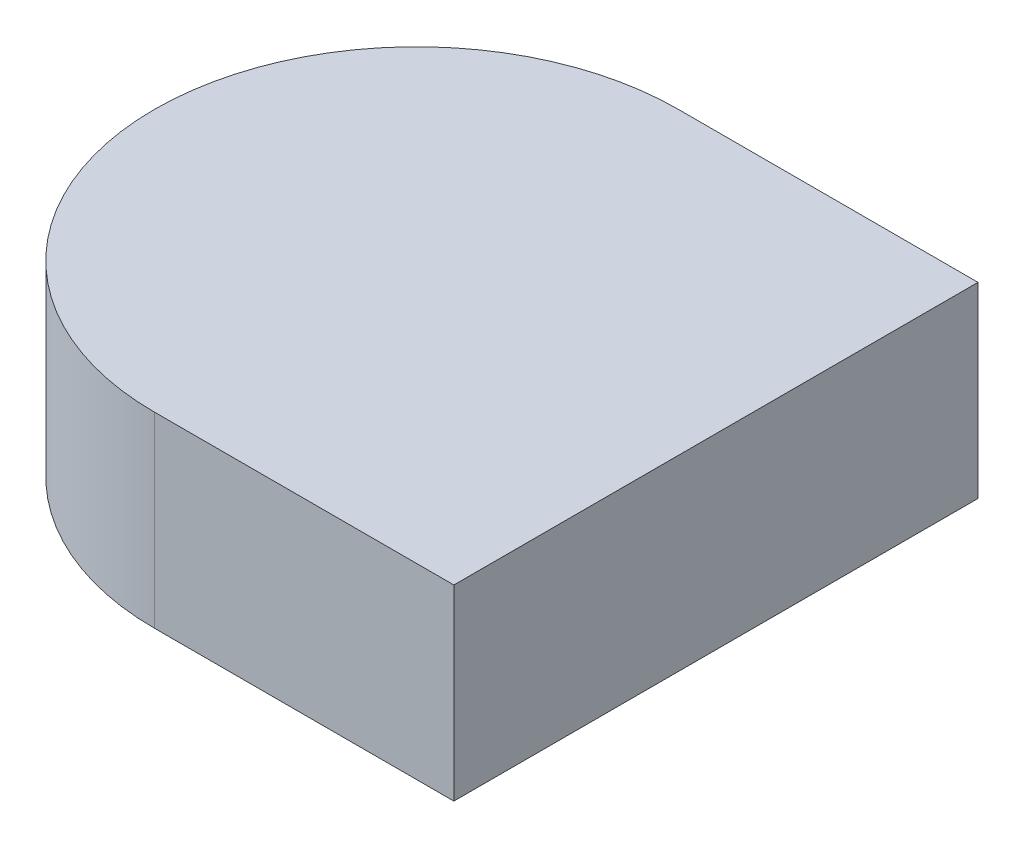
ISO-10303-21;
HEADER;
FILE_DESCRIPTION(('STEP AP214'),'2;1');
FILE_NAME('part.step','',(''),(''),'','','');
FILE_SCHEMA(('AUTOMOTIVE_DESIGN { 1 0 10303 214 1 1 1 1 }'));
ENDSEC;
DATA;
#1=APPLICATION_CONTEXT('core data for automotive mechanical design processes');
#2=APPLICATION_PROTOCOL_DEFINITION('international standard','automotive_design',2000,#1);
#3=PRODUCT_CONTEXT('',#1,'mechanical');
#4=PRODUCT('Part','Part','',(#3));
#5=PRODUCT_RELATED_PRODUCT_CATEGORY('part','',(#4));
#6=PRODUCT_DEFINITION_FORMATION('','',#4);
#7=PRODUCT_DEFINITION_CONTEXT('part definition',#1,'design');
#8=PRODUCT_DEFINITION('design','',#6,#7);
#9=PRODUCT_DEFINITION_SHAPE('','',#8);
#10=(LENGTH_UNIT() NAMED_UNIT(*) SI_UNIT(.MILLI.,.METRE.));
#11=(NAMED_UNIT(*) PLANE_ANGLE_UNIT() SI_UNIT($,.RADIAN.));
#12=(NAMED_UNIT(*) SI_UNIT($,.STERADIAN.) SOLID_ANGLE_UNIT());
#13=UNCERTAINTY_MEASURE_WITH_UNIT(LENGTH_MEASURE(1.E-05),#10,'distance_accuracy_value','');
#14=(GEOMETRIC_REPRESENTATION_CONTEXT(3) GLOBAL_UNCERTAINTY_ASSIGNED_CONTEXT((#13)) GLOBAL_UNIT_ASSIGNED_CONTEXT((#10,
#11,#12)) REPRESENTATION_CONTEXT('',''));
#15=CARTESIAN_POINT('',(0.,0.,0.));
#16=DIRECTION('',(0.,0.,1.));
#17=DIRECTION('',(1.,0.,0.));
#18=AXIS2_PLACEMENT_3D('',#15,#16,#17);
#19=CARTESIAN_POINT('',(5.08,-3.175,4.445));
#20=DIRECTION('',(0.,1.,0.));
#21=DIRECTION('',(-1.,0.,0.));
#22=AXIS2_PLACEMENT_3D('',#19,#20,#21);
#23=PLANE('',#22);
#24=DIRECTION('',(0.,0.,-1.));
#25=VECTOR('',#24,1.);
#26=CARTESIAN_POINT('',(-2.54,-3.175,2.54));
#27=LINE('',#26,#25);
#28=CARTESIAN_POINT('',(-2.54,-3.175,2.54));
#29=VERTEX_POINT('',#28);
#30=CARTESIAN_POINT('',(-2.54,-3.175,-2.54));
#31=VERTEX_POINT('',#30);
#32=EDGE_CURVE('E148',#29,#31,#27,.T.);
#33=ORIENTED_EDGE('',*,*,#32,.F.);
#34=DIRECTION('',(-1.,0.,0.));
#35=VECTOR('',#34,1.);
#36=CARTESIAN_POINT('',(2.54,-3.175,2.54));
#37=LINE('',#36,#35);
#38=CARTESIAN_POINT('',(2.54,-3.175,2.54));
#39=VERTEX_POINT('',#38);
#40=EDGE_CURVE('E59',#39,#29,#37,.T.);
#41=ORIENTED_EDGE('',*,*,#40,.F.);
#42=DIRECTION('',(0.,0.,1.));
#43=VECTOR('',#42,1.);
#44=CARTESIAN_POINT('',(2.54,-3.175,-2.54));
#45=LINE('',#44,#43);
#46=CARTESIAN_POINT('',(2.54,-3.175,-2.54));
#47=VERTEX_POINT('',#46);
#48=EDGE_CURVE('E141',#47,#39,#45,.T.);
#49=ORIENTED_EDGE('',*,*,#48,.F.);
#50=DIRECTION('',(1.,0.,0.));
#51=VECTOR('',#50,1.);
#52=CARTESIAN_POINT('',(-2.54,-3.175,-2.54));
#53=LINE('',#52,#51);
#54=EDGE_CURVE('E145',#31,#47,#53,.T.);
#55=ORIENTED_EDGE('',*,*,#54,.F.);
#56=EDGE_LOOP('',(#33,#41,#49,#55));
#57=FACE_BOUND('',#56,.T.);
#58=DIRECTION('',(1.,0.,0.));
#59=VECTOR('',#58,1.);
#60=CARTESIAN_POINT('',(5.08,-3.175,4.445));
#61=LINE('',#60,#59);
#62=CARTESIAN_POINT('',(0.,-3.175,4.445));
#63=VERTEX_POINT('',#62);
#64=CARTESIAN_POINT('',(5.08,-3.175,4.445));
#65=VERTEX_POINT('',#64);
#66=EDGE_CURVE('E124',#63,#65,#61,.T.);
#67=ORIENTED_EDGE('',*,*,#66,.F.);
#68=CARTESIAN_POINT('',(0.,-3.175,0.));
#69=DIRECTION('',(0.,-1.,0.));
#70=DIRECTION('',(0.,0.,1.));
#71=AXIS2_PLACEMENT_3D('',#68,#69,#70);
#72=CIRCLE('',#71,4.445);
#73=CARTESIAN_POINT('',(0.,-3.175,-4.445));
#74=VERTEX_POINT('',#73);
#75=EDGE_CURVE('E163',#63,#74,#72,.T.);
#76=ORIENTED_EDGE('',*,*,#75,.T.);
#77=DIRECTION('',(1.,0.,0.));
#78=VECTOR('',#77,1.);
#79=CARTESIAN_POINT('',(5.08,-3.175,-4.445));
#80=LINE('',#79,#78);
#81=CARTESIAN_POINT('',(5.08,-3.175,-4.445));
#82=VERTEX_POINT('',#81);
#83=EDGE_CURVE('E103',#74,#82,#80,.T.);
#84=ORIENTED_EDGE('',*,*,#83,.T.);
#85=DIRECTION('',(0.,0.,-1.));
#86=VECTOR('',#85,1.);
#87=CARTESIAN_POINT('',(5.08,-3.175,4.445));
#88=LINE('',#87,#86);
#89=EDGE_CURVE('E12',#65,#82,#88,.T.);
#90=ORIENTED_EDGE('',*,*,#89,.F.);
#91=EDGE_LOOP('',(#67,#76,#84,#90));
#92=FACE_BOUND('',#91,.T.);
#93=ADVANCED_FACE('F36',(#57,#92),#23,.F.);
#94=CARTESIAN_POINT('',(5.08,0.,4.445));
#95=DIRECTION('',(-1.,0.,0.));
#96=DIRECTION('',(0.,0.,1.));
#97=AXIS2_PLACEMENT_3D('',#94,#95,#96);
#98=PLANE('',#97);
#99=DIRECTION('',(0.,1.,0.));
#100=VECTOR('',#99,1.);
#101=CARTESIAN_POINT('',(5.08,0.,-4.445));
#102=LINE('',#101,#100);
#103=CARTESIAN_POINT('',(5.08,0.,-4.445));
#104=VERTEX_POINT('',#103);
#105=EDGE_CURVE('E108',#82,#104,#102,.T.);
#106=ORIENTED_EDGE('',*,*,#105,.T.);
#107=DIRECTION('',(0.,0.,-1.));
#108=VECTOR('',#107,1.);
#109=CARTESIAN_POINT('',(5.08,0.,4.445));
#110=LINE('',#109,#108);
#111=CARTESIAN_POINT('',(5.08,0.,4.445));
#112=VERTEX_POINT('',#111);
#113=EDGE_CURVE('E44',#112,#104,#110,.T.);
#114=ORIENTED_EDGE('',*,*,#113,.F.);
#115=DIRECTION('',(0.,1.,0.));
#116=VECTOR('',#115,1.);
#117=CARTESIAN_POINT('',(5.08,0.,4.445));
#118=LINE('',#117,#116);
#119=EDGE_CURVE('E126',#65,#112,#118,.T.);
#120=ORIENTED_EDGE('',*,*,#119,.F.);
#121=ORIENTED_EDGE('',*,*,#89,.T.);
#122=EDGE_LOOP('',(#106,#114,#120,#121));
#123=FACE_BOUND('',#122,.T.);
#124=ADVANCED_FACE('F110',(#123),#98,.F.);
#125=CARTESIAN_POINT('',(-5.08,0.,4.445));
#126=DIRECTION('',(0.,-1.,0.));
#127=DIRECTION('',(0.,0.,-1.));
#128=AXIS2_PLACEMENT_3D('',#125,#126,#127);
#129=PLANE('',#128);
#130=DIRECTION('',(-1.,0.,0.));
#131=VECTOR('',#130,1.);
#132=CARTESIAN_POINT('',(-5.08,0.,-4.445));
#133=LINE('',#132,#131);
#134=CARTESIAN_POINT('',(0.,0.,-4.445));
#135=VERTEX_POINT('',#134);
#136=EDGE_CURVE('E115',#104,#135,#133,.T.);
#137=ORIENTED_EDGE('',*,*,#136,.T.);
#138=CARTESIAN_POINT('',(0.,0.,0.));
#139=DIRECTION('',(0.,1.,0.));
#140=DIRECTION('',(0.,0.,1.));
#141=AXIS2_PLACEMENT_3D('',#138,#139,#140);
#142=CIRCLE('',#141,4.445);
#143=CARTESIAN_POINT('',(0.,0.,4.445));
#144=VERTEX_POINT('',#143);
#145=EDGE_CURVE('E39',#144,#135,#142,.F.);
#146=ORIENTED_EDGE('',*,*,#145,.F.);
#147=DIRECTION('',(-1.,0.,0.));
#148=VECTOR('',#147,1.);
#149=CARTESIAN_POINT('',(-5.08,0.,4.445));
#150=LINE('',#149,#148);
#151=EDGE_CURVE('E121',#112,#144,#150,.T.);
#152=ORIENTED_EDGE('',*,*,#151,.F.);
#153=ORIENTED_EDGE('',*,*,#113,.T.);
#154=EDGE_LOOP('',(#137,#146,#152,#153));
#155=FACE_BOUND('',#154,.T.);
#156=ADVANCED_FACE('F119',(#155),#129,.F.);
#157=CARTESIAN_POINT('',(0.,0.,4.445));
#158=DIRECTION('',(0.,0.,-1.));
#159=DIRECTION('',(-1.,0.,0.));
#160=AXIS2_PLACEMENT_3D('',#157,#158,#159);
#161=PLANE('',#160);
#162=ORIENTED_EDGE('',*,*,#151,.T.);
#163=DIRECTION('',(0.,1.,0.));
#164=VECTOR('',#163,1.);
#165=CARTESIAN_POINT('',(0.,-3.175,4.445));
#166=LINE('',#165,#164);
#167=EDGE_CURVE('E71',#63,#144,#166,.T.);
#168=ORIENTED_EDGE('',*,*,#167,.F.);
#169=ORIENTED_EDGE('',*,*,#66,.T.);
#170=ORIENTED_EDGE('',*,*,#119,.T.);
#171=EDGE_LOOP('',(#162,#168,#169,#170));
#172=FACE_BOUND('',#171,.T.);
#173=ADVANCED_FACE('F204',(#172),#161,.F.);
#174=CARTESIAN_POINT('',(0.,0.,-4.445));
#175=DIRECTION('',(0.,0.,-1.));
#176=DIRECTION('',(-1.,0.,0.));
#177=AXIS2_PLACEMENT_3D('',#174,#175,#176);
#178=PLANE('',#177);
#179=DIRECTION('',(0.,1.,0.));
#180=VECTOR('',#179,1.);
#181=CARTESIAN_POINT('',(0.,-3.175,-4.445));
#182=LINE('',#181,#180);
#183=EDGE_CURVE('E74',#74,#135,#182,.T.);
#184=ORIENTED_EDGE('',*,*,#183,.T.);
#185=ORIENTED_EDGE('',*,*,#136,.F.);
#186=ORIENTED_EDGE('',*,*,#105,.F.);
#187=ORIENTED_EDGE('',*,*,#83,.F.);
#188=EDGE_LOOP('',(#184,#185,#186,#187));
#189=FACE_BOUND('',#188,.T.);
#190=ADVANCED_FACE('F123',(#189),#178,.T.);
#191=CARTESIAN_POINT('',(2.54,-1.27,2.54));
#192=DIRECTION('',(0.,0.,1.));
#193=DIRECTION('',(1.,0.,0.));
#194=AXIS2_PLACEMENT_3D('',#191,#192,#193);
#195=PLANE('',#194);
#196=ORIENTED_EDGE('',*,*,#40,.T.);
#197=DIRECTION('',(0.,-1.,0.));
#198=VECTOR('',#197,1.);
#199=CARTESIAN_POINT('',(-2.54,-1.27,2.54));
#200=LINE('',#199,#198);
#201=CARTESIAN_POINT('',(-2.54,-1.27,2.54));
#202=VERTEX_POINT('',#201);
#203=EDGE_CURVE('E133',#202,#29,#200,.T.);
#204=ORIENTED_EDGE('',*,*,#203,.F.);
#205=DIRECTION('',(-1.,0.,0.));
#206=VECTOR('',#205,1.);
#207=CARTESIAN_POINT('',(2.54,-1.27,2.54));
#208=LINE('',#207,#206);
#209=CARTESIAN_POINT('',(2.54,-1.27,2.54));
#210=VERTEX_POINT('',#209);
#211=EDGE_CURVE('E144',#210,#202,#208,.T.);
#212=ORIENTED_EDGE('',*,*,#211,.F.);
#213=DIRECTION('',(0.,-1.,0.));
#214=VECTOR('',#213,1.);
#215=CARTESIAN_POINT('',(2.54,-1.27,2.54));
#216=LINE('',#215,#214);
#217=EDGE_CURVE('E130',#210,#39,#216,.T.);
#218=ORIENTED_EDGE('',*,*,#217,.T.);
#219=EDGE_LOOP('',(#196,#204,#212,#218));
#220=FACE_BOUND('',#219,.T.);
#221=ADVANCED_FACE('F190',(#220),#195,.F.);
#222=CARTESIAN_POINT('',(2.54,-1.27,-2.54));
#223=DIRECTION('',(1.,0.,0.));
#224=DIRECTION('',(0.,1.,0.));
#225=AXIS2_PLACEMENT_3D('',#222,#223,#224);
#226=PLANE('',#225);
#227=ORIENTED_EDGE('',*,*,#48,.T.);
#228=ORIENTED_EDGE('',*,*,#217,.F.);
#229=DIRECTION('',(0.,0.,1.));
#230=VECTOR('',#229,1.);
#231=CARTESIAN_POINT('',(2.54,-1.27,-2.54));
#232=LINE('',#231,#230);
#233=CARTESIAN_POINT('',(2.54,-1.27,-2.54));
#234=VERTEX_POINT('',#233);
#235=EDGE_CURVE('E136',#234,#210,#232,.T.);
#236=ORIENTED_EDGE('',*,*,#235,.F.);
#237=DIRECTION('',(0.,-1.,0.));
#238=VECTOR('',#237,1.);
#239=CARTESIAN_POINT('',(2.54,-1.27,-2.54));
#240=LINE('',#239,#238);
#241=EDGE_CURVE('E138',#234,#47,#240,.T.);
#242=ORIENTED_EDGE('',*,*,#241,.T.);
#243=EDGE_LOOP('',(#227,#228,#236,#242));
#244=FACE_BOUND('',#243,.T.);
#245=ADVANCED_FACE('F198',(#244),#226,.F.);
#246=CARTESIAN_POINT('',(-2.54,-1.27,-2.54));
#247=DIRECTION('',(0.,0.,-1.));
#248=DIRECTION('',(-1.,0.,0.));
#249=AXIS2_PLACEMENT_3D('',#246,#247,#248);
#250=PLANE('',#249);
#251=ORIENTED_EDGE('',*,*,#54,.T.);
#252=ORIENTED_EDGE('',*,*,#241,.F.);
#253=DIRECTION('',(1.,0.,0.));
#254=VECTOR('',#253,1.);
#255=CARTESIAN_POINT('',(-2.54,-1.27,-2.54));
#256=LINE('',#255,#254);
#257=CARTESIAN_POINT('',(-2.54,-1.27,-2.54));
#258=VERTEX_POINT('',#257);
#259=EDGE_CURVE('E154',#258,#234,#256,.T.);
#260=ORIENTED_EDGE('',*,*,#259,.F.);
#261=DIRECTION('',(0.,-1.,0.));
#262=VECTOR('',#261,1.);
#263=CARTESIAN_POINT('',(-2.54,-1.27,-2.54));
#264=LINE('',#263,#262);
#265=EDGE_CURVE('E135',#258,#31,#264,.T.);
#266=ORIENTED_EDGE('',*,*,#265,.T.);
#267=EDGE_LOOP('',(#251,#252,#260,#266));
#268=FACE_BOUND('',#267,.T.);
#269=ADVANCED_FACE('F196',(#268),#250,.F.);
#270=CARTESIAN_POINT('',(-2.54,-1.27,2.54));
#271=DIRECTION('',(-1.,0.,0.));
#272=DIRECTION('',(0.,-1.,0.));
#273=AXIS2_PLACEMENT_3D('',#270,#271,#272);
#274=PLANE('',#273);
#275=ORIENTED_EDGE('',*,*,#32,.T.);
#276=ORIENTED_EDGE('',*,*,#265,.F.);
#277=DIRECTION('',(0.,0.,-1.));
#278=VECTOR('',#277,1.);
#279=CARTESIAN_POINT('',(-2.54,-1.27,2.54));
#280=LINE('',#279,#278);
#281=EDGE_CURVE('E157',#202,#258,#280,.T.);
#282=ORIENTED_EDGE('',*,*,#281,.F.);
#283=ORIENTED_EDGE('',*,*,#203,.T.);
#284=EDGE_LOOP('',(#275,#276,#282,#283));
#285=FACE_BOUND('',#284,.T.);
#286=ADVANCED_FACE('F185',(#285),#274,.F.);
#287=CARTESIAN_POINT('',(0.,-1.27,0.));
#288=DIRECTION('',(0.,-1.,0.));
#289=DIRECTION('',(1.,0.,0.));
#290=AXIS2_PLACEMENT_3D('',#287,#288,#289);
#291=PLANE('',#290);
#292=CARTESIAN_POINT('',(0.,-1.27,0.));
#293=DIRECTION('',(0.,-1.,0.));
#294=DIRECTION('',(1.,0.,0.));
#295=AXIS2_PLACEMENT_3D('',#292,#293,#294);
#296=CIRCLE('',#295,1.5875);
#297=CARTESIAN_POINT('',(1.5875,-1.27,0.));
#298=VERTEX_POINT('',#297);
#299=EDGE_CURVE('E167',#298,#298,#296,.T.);
#300=ORIENTED_EDGE('',*,*,#299,.F.);
#301=EDGE_LOOP('',(#300));
#302=FACE_BOUND('',#301,.T.);
#303=ORIENTED_EDGE('',*,*,#211,.T.);
#304=ORIENTED_EDGE('',*,*,#281,.T.);
#305=ORIENTED_EDGE('',*,*,#259,.T.);
#306=ORIENTED_EDGE('',*,*,#235,.T.);
#307=EDGE_LOOP('',(#303,#304,#305,#306));
#308=FACE_BOUND('',#307,.T.);
#309=ADVANCED_FACE('F182',(#302,#308),#291,.T.);
#310=CARTESIAN_POINT('',(0.,-3.175,0.));
#311=DIRECTION('',(0.,1.,0.));
#312=DIRECTION('',(0.,0.,1.));
#313=AXIS2_PLACEMENT_3D('',#310,#311,#312);
#314=CYLINDRICAL_SURFACE('',#313,4.445);
#315=ORIENTED_EDGE('',*,*,#183,.F.);
#316=ORIENTED_EDGE('',*,*,#75,.F.);
#317=ORIENTED_EDGE('',*,*,#167,.T.);
#318=ORIENTED_EDGE('',*,*,#145,.T.);
#319=EDGE_LOOP('',(#315,#316,#317,#318));
#320=FACE_BOUND('',#319,.T.);
#321=ADVANCED_FACE('F178',(#320),#314,.T.);
#322=CARTESIAN_POINT('',(0.,-1.0668,0.));
#323=DIRECTION('',(0.,-1.,0.));
#324=DIRECTION('',(1.,0.,0.));
#325=AXIS2_PLACEMENT_3D('',#322,#323,#324);
#326=CYLINDRICAL_SURFACE('',#325,1.5875);
#327=CARTESIAN_POINT('',(0.,-1.0668,0.));
#328=DIRECTION('',(0.,-1.,0.));
#329=DIRECTION('',(1.,0.,0.));
#330=AXIS2_PLACEMENT_3D('',#327,#328,#329);
#331=CIRCLE('',#330,1.5875);
#332=CARTESIAN_POINT('',(1.5875,-1.0668,0.));
#333=VERTEX_POINT('',#332);
#334=EDGE_CURVE('E166',#333,#333,#331,.T.);
#335=ORIENTED_EDGE('',*,*,#334,.F.);
#336=EDGE_LOOP('',(#335));
#337=FACE_BOUND('',#336,.T.);
#338=ORIENTED_EDGE('',*,*,#299,.T.);
#339=EDGE_LOOP('',(#338));
#340=FACE_BOUND('',#339,.T.);
#341=ADVANCED_FACE('F175',(#337,#340),#326,.F.);
#342=CARTESIAN_POINT('',(0.,-1.0668,0.));
#343=DIRECTION('',(0.,-1.,0.));
#344=DIRECTION('',(1.,0.,0.));
#345=AXIS2_PLACEMENT_3D('',#342,#343,#344);
#346=PLANE('',#345);
#347=ORIENTED_EDGE('',*,*,#334,.T.);
#348=EDGE_LOOP('',(#347));
#349=FACE_BOUND('',#348,.T.);
#350=ADVANCED_FACE('F173',(#349),#346,.T.);
#351=CLOSED_SHELL('',(#93,#124,#156,#173,#190,#221,#245,#269,#286,#309,#321,#341,#350));
#352=MANIFOLD_SOLID_BREP('B2',#351);
#353=ADVANCED_BREP_SHAPE_REPRESENTATION('',(#18,#352),#14);
#354=SHAPE_DEFINITION_REPRESENTATION(#9,#353);
ENDSEC;
END-ISO-10303-21;
